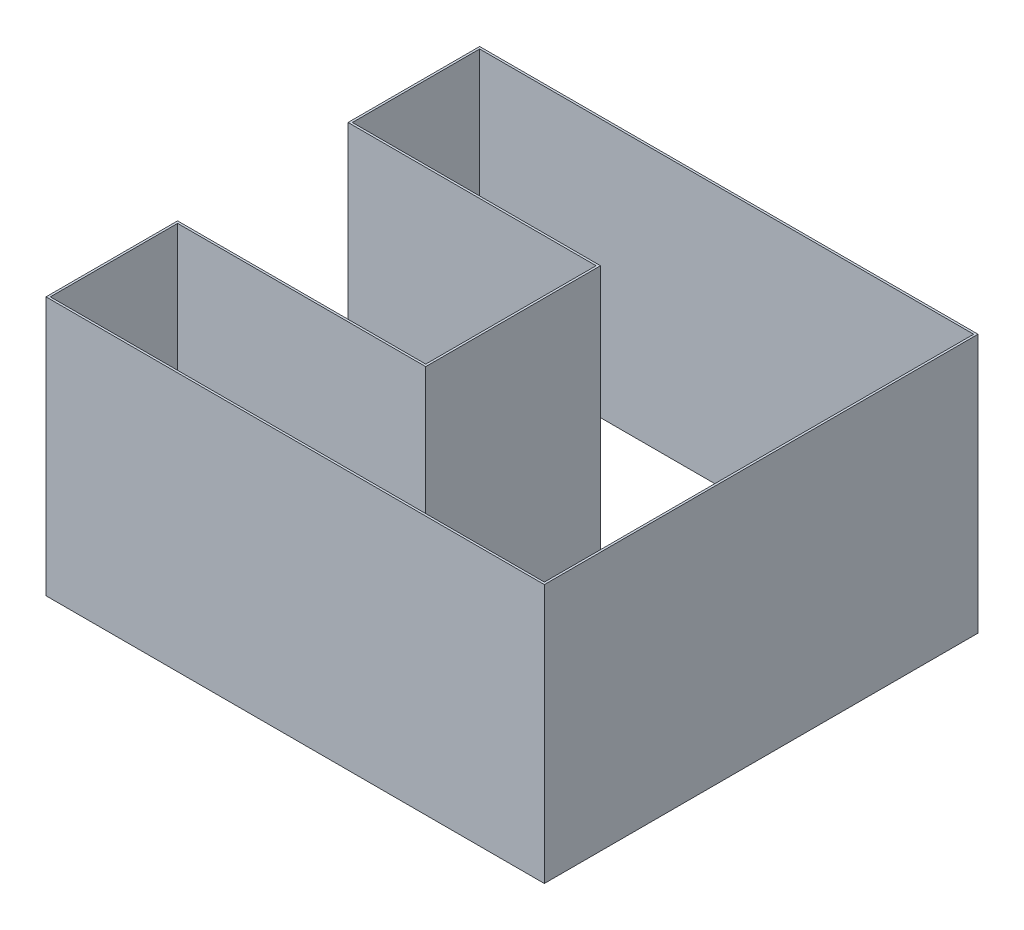
ISO-10303-21;
HEADER;
FILE_DESCRIPTION(('STEP AP214'),'2;1');
FILE_NAME('part.step','',(''),(''),'','','');
FILE_SCHEMA(('AUTOMOTIVE_DESIGN { 1 0 10303 214 1 1 1 1 }'));
ENDSEC;
DATA;
#1=APPLICATION_CONTEXT('core data for automotive mechanical design processes');
#2=APPLICATION_PROTOCOL_DEFINITION('international standard','automotive_design',2000,#1);
#3=PRODUCT_CONTEXT('',#1,'mechanical');
#4=PRODUCT('Part','Part','',(#3));
#5=PRODUCT_RELATED_PRODUCT_CATEGORY('part','',(#4));
#6=PRODUCT_DEFINITION_FORMATION('','',#4);
#7=PRODUCT_DEFINITION_CONTEXT('part definition',#1,'design');
#8=PRODUCT_DEFINITION('design','',#6,#7);
#9=PRODUCT_DEFINITION_SHAPE('','',#8);
#10=(LENGTH_UNIT() NAMED_UNIT(*) SI_UNIT(.MILLI.,.METRE.));
#11=(NAMED_UNIT(*) PLANE_ANGLE_UNIT() SI_UNIT($,.RADIAN.));
#12=(NAMED_UNIT(*) SI_UNIT($,.STERADIAN.) SOLID_ANGLE_UNIT());
#13=UNCERTAINTY_MEASURE_WITH_UNIT(LENGTH_MEASURE(1.E-05),#10,'distance_accuracy_value','');
#14=(GEOMETRIC_REPRESENTATION_CONTEXT(3) GLOBAL_UNCERTAINTY_ASSIGNED_CONTEXT((#13)) GLOBAL_UNIT_ASSIGNED_CONTEXT((#10,
#11,#12)) REPRESENTATION_CONTEXT('',''));
#15=CARTESIAN_POINT('',(0.,0.,0.));
#16=DIRECTION('',(0.,0.,1.));
#17=DIRECTION('',(1.,0.,0.));
#18=AXIS2_PLACEMENT_3D('',#15,#16,#17);
#19=CARTESIAN_POINT('',(0.,-0.12,0.));
#20=DIRECTION('',(0.,1.,0.));
#21=DIRECTION('',(0.,0.,1.));
#22=AXIS2_PLACEMENT_3D('',#19,#20,#21);
#23=PLANE('',#22);
#24=DIRECTION('',(-1.,0.,0.));
#25=VECTOR('',#24,1.);
#26=CARTESIAN_POINT('',(0.,-0.12,-0.04));
#27=LINE('',#26,#25);
#28=CARTESIAN_POINT('',(0.,-0.12,-0.04));
#29=VERTEX_POINT('',#28);
#30=CARTESIAN_POINT('',(-0.115,-0.12,-0.04));
#31=VERTEX_POINT('',#30);
#32=EDGE_CURVE('E260',#29,#31,#27,.T.);
#33=ORIENTED_EDGE('',*,*,#32,.T.);
#34=DIRECTION('',(0.,0.,1.));
#35=VECTOR('',#34,1.);
#36=CARTESIAN_POINT('',(-0.115,-0.12,0.));
#37=LINE('',#36,#35);
#38=CARTESIAN_POINT('',(-0.115,-0.12,-0.101));
#39=VERTEX_POINT('',#38);
#40=EDGE_CURVE('E262',#39,#31,#37,.T.);
#41=ORIENTED_EDGE('',*,*,#40,.F.);
#42=DIRECTION('',(1.,0.,0.));
#43=VECTOR('',#42,1.);
#44=CARTESIAN_POINT('',(0.,-0.12,-0.101));
#45=LINE('',#44,#43);
#46=CARTESIAN_POINT('',(0.116,-0.12,-0.101));
#47=VERTEX_POINT('',#46);
#48=EDGE_CURVE('E266',#39,#47,#45,.T.);
#49=ORIENTED_EDGE('',*,*,#48,.T.);
#50=DIRECTION('',(0.,0.,1.));
#51=VECTOR('',#50,1.);
#52=CARTESIAN_POINT('',(0.116,-0.12,0.));
#53=LINE('',#52,#51);
#54=CARTESIAN_POINT('',(0.116,-0.12,0.1));
#55=VERTEX_POINT('',#54);
#56=EDGE_CURVE('E268',#47,#55,#53,.T.);
#57=ORIENTED_EDGE('',*,*,#56,.T.);
#58=DIRECTION('',(1.,0.,0.));
#59=VECTOR('',#58,1.);
#60=CARTESIAN_POINT('',(0.,-0.12,0.1));
#61=LINE('',#60,#59);
#62=CARTESIAN_POINT('',(-0.115,-0.12,0.1));
#63=VERTEX_POINT('',#62);
#64=EDGE_CURVE('E270',#63,#55,#61,.T.);
#65=ORIENTED_EDGE('',*,*,#64,.F.);
#66=DIRECTION('',(0.,0.,1.));
#67=VECTOR('',#66,1.);
#68=CARTESIAN_POINT('',(-0.115,-0.12,0.));
#69=LINE('',#68,#67);
#70=CARTESIAN_POINT('',(-0.115,-0.12,0.039));
#71=VERTEX_POINT('',#70);
#72=EDGE_CURVE('E273',#71,#63,#69,.T.);
#73=ORIENTED_EDGE('',*,*,#72,.F.);
#74=DIRECTION('',(1.,0.,0.));
#75=VECTOR('',#74,1.);
#76=CARTESIAN_POINT('',(0.,-0.12,0.039));
#77=LINE('',#76,#75);
#78=CARTESIAN_POINT('',(0.,-0.12,0.039));
#79=VERTEX_POINT('',#78);
#80=EDGE_CURVE('E276',#71,#79,#77,.T.);
#81=ORIENTED_EDGE('',*,*,#80,.T.);
#82=DIRECTION('',(0.,0.,-1.));
#83=VECTOR('',#82,1.);
#84=CARTESIAN_POINT('',(0.,-0.12,0.));
#85=LINE('',#84,#83);
#86=EDGE_CURVE('E278',#79,#29,#85,.T.);
#87=ORIENTED_EDGE('',*,*,#86,.T.);
#88=EDGE_LOOP('',(#33,#41,#49,#57,#65,#73,#81,#87));
#89=FACE_BOUND('',#88,.T.);
#90=DIRECTION('',(-1.,0.,0.));
#91=VECTOR('',#90,1.);
#92=CARTESIAN_POINT('',(0.,-0.12,-0.041));
#93=LINE('',#92,#91);
#94=CARTESIAN_POINT('',(0.000999999999999997,-0.12,-0.041));
#95=VERTEX_POINT('',#94);
#96=CARTESIAN_POINT('',(-0.114,-0.12,-0.041));
#97=VERTEX_POINT('',#96);
#98=EDGE_CURVE('E192',#95,#97,#93,.T.);
#99=ORIENTED_EDGE('',*,*,#98,.F.);
#100=DIRECTION('',(0.,0.,-1.));
#101=VECTOR('',#100,1.);
#102=CARTESIAN_POINT('',(0.000999999999999997,-0.12,0.));
#103=LINE('',#102,#101);
#104=CARTESIAN_POINT('',(0.000999999999999997,-0.12,0.04));
#105=VERTEX_POINT('',#104);
#106=EDGE_CURVE('E228',#105,#95,#103,.T.);
#107=ORIENTED_EDGE('',*,*,#106,.F.);
#108=DIRECTION('',(1.,0.,0.));
#109=VECTOR('',#108,1.);
#110=CARTESIAN_POINT('',(0.,-0.12,0.04));
#111=LINE('',#110,#109);
#112=CARTESIAN_POINT('',(-0.114,-0.12,0.04));
#113=VERTEX_POINT('',#112);
#114=EDGE_CURVE('E226',#113,#105,#111,.T.);
#115=ORIENTED_EDGE('',*,*,#114,.F.);
#116=DIRECTION('',(0.,0.,1.));
#117=VECTOR('',#116,1.);
#118=CARTESIAN_POINT('',(-0.114,-0.12,0.));
#119=LINE('',#118,#117);
#120=CARTESIAN_POINT('',(-0.114,-0.12,0.099));
#121=VERTEX_POINT('',#120);
#122=EDGE_CURVE('E223',#113,#121,#119,.T.);
#123=ORIENTED_EDGE('',*,*,#122,.T.);
#124=DIRECTION('',(1.,0.,0.));
#125=VECTOR('',#124,1.);
#126=CARTESIAN_POINT('',(0.,-0.12,0.099));
#127=LINE('',#126,#125);
#128=CARTESIAN_POINT('',(0.115,-0.12,0.099));
#129=VERTEX_POINT('',#128);
#130=EDGE_CURVE('E220',#121,#129,#127,.T.);
#131=ORIENTED_EDGE('',*,*,#130,.T.);
#132=DIRECTION('',(0.,0.,1.));
#133=VECTOR('',#132,1.);
#134=CARTESIAN_POINT('',(0.115,-0.12,0.));
#135=LINE('',#134,#133);
#136=CARTESIAN_POINT('',(0.115,-0.12,-0.1));
#137=VERTEX_POINT('',#136);
#138=EDGE_CURVE('E216',#137,#129,#135,.T.);
#139=ORIENTED_EDGE('',*,*,#138,.F.);
#140=DIRECTION('',(1.,0.,0.));
#141=VECTOR('',#140,1.);
#142=CARTESIAN_POINT('',(0.,-0.12,-0.1));
#143=LINE('',#142,#141);
#144=CARTESIAN_POINT('',(-0.114,-0.12,-0.1));
#145=VERTEX_POINT('',#144);
#146=EDGE_CURVE('E214',#145,#137,#143,.T.);
#147=ORIENTED_EDGE('',*,*,#146,.F.);
#148=DIRECTION('',(0.,0.,1.));
#149=VECTOR('',#148,1.);
#150=CARTESIAN_POINT('',(-0.114,-0.12,0.));
#151=LINE('',#150,#149);
#152=EDGE_CURVE('E201',#145,#97,#151,.T.);
#153=ORIENTED_EDGE('',*,*,#152,.T.);
#154=EDGE_LOOP('',(#99,#107,#115,#123,#131,#139,#147,#153));
#155=FACE_BOUND('',#154,.T.);
#156=ADVANCED_FACE('F81',(#89,#155),#23,.F.);
#157=CARTESIAN_POINT('',(0.,0.,0.));
#158=DIRECTION('',(0.,1.,0.));
#159=DIRECTION('',(0.,0.,1.));
#160=AXIS2_PLACEMENT_3D('',#157,#158,#159);
#161=PLANE('',#160);
#162=DIRECTION('',(-1.,0.,0.));
#163=VECTOR('',#162,1.);
#164=CARTESIAN_POINT('',(0.,0.,-0.04));
#165=LINE('',#164,#163);
#166=CARTESIAN_POINT('',(0.,0.,-0.04));
#167=VERTEX_POINT('',#166);
#168=CARTESIAN_POINT('',(-0.115,0.,-0.04));
#169=VERTEX_POINT('',#168);
#170=EDGE_CURVE('E210',#167,#169,#165,.T.);
#171=ORIENTED_EDGE('',*,*,#170,.F.);
#172=DIRECTION('',(0.,0.,-1.));
#173=VECTOR('',#172,1.);
#174=CARTESIAN_POINT('',(0.,0.,0.));
#175=LINE('',#174,#173);
#176=CARTESIAN_POINT('',(0.,0.,0.039));
#177=VERTEX_POINT('',#176);
#178=EDGE_CURVE('E263',#177,#167,#175,.T.);
#179=ORIENTED_EDGE('',*,*,#178,.F.);
#180=DIRECTION('',(1.,0.,0.));
#181=VECTOR('',#180,1.);
#182=CARTESIAN_POINT('',(0.,0.,0.039));
#183=LINE('',#182,#181);
#184=CARTESIAN_POINT('',(-0.115,0.,0.039));
#185=VERTEX_POINT('',#184);
#186=EDGE_CURVE('E297',#185,#177,#183,.T.);
#187=ORIENTED_EDGE('',*,*,#186,.F.);
#188=DIRECTION('',(0.,0.,1.));
#189=VECTOR('',#188,1.);
#190=CARTESIAN_POINT('',(-0.115,0.,0.));
#191=LINE('',#190,#189);
#192=CARTESIAN_POINT('',(-0.115,0.,0.1));
#193=VERTEX_POINT('',#192);
#194=EDGE_CURVE('E294',#185,#193,#191,.T.);
#195=ORIENTED_EDGE('',*,*,#194,.T.);
#196=DIRECTION('',(1.,0.,0.));
#197=VECTOR('',#196,1.);
#198=CARTESIAN_POINT('',(0.,0.,0.1));
#199=LINE('',#198,#197);
#200=CARTESIAN_POINT('',(0.116,0.,0.1));
#201=VERTEX_POINT('',#200);
#202=EDGE_CURVE('E291',#193,#201,#199,.T.);
#203=ORIENTED_EDGE('',*,*,#202,.T.);
#204=DIRECTION('',(0.,0.,1.));
#205=VECTOR('',#204,1.);
#206=CARTESIAN_POINT('',(0.116,0.,0.));
#207=LINE('',#206,#205);
#208=CARTESIAN_POINT('',(0.116,0.,-0.101));
#209=VERTEX_POINT('',#208);
#210=EDGE_CURVE('E288',#209,#201,#207,.T.);
#211=ORIENTED_EDGE('',*,*,#210,.F.);
#212=DIRECTION('',(1.,0.,0.));
#213=VECTOR('',#212,1.);
#214=CARTESIAN_POINT('',(0.,0.,-0.101));
#215=LINE('',#214,#213);
#216=CARTESIAN_POINT('',(-0.115,0.,-0.101));
#217=VERTEX_POINT('',#216);
#218=EDGE_CURVE('E286',#217,#209,#215,.T.);
#219=ORIENTED_EDGE('',*,*,#218,.F.);
#220=DIRECTION('',(0.,0.,1.));
#221=VECTOR('',#220,1.);
#222=CARTESIAN_POINT('',(-0.115,0.,0.));
#223=LINE('',#222,#221);
#224=EDGE_CURVE('E283',#217,#169,#223,.T.);
#225=ORIENTED_EDGE('',*,*,#224,.T.);
#226=EDGE_LOOP('',(#171,#179,#187,#195,#203,#211,#219,#225));
#227=FACE_BOUND('',#226,.T.);
#228=DIRECTION('',(0.,0.,-1.));
#229=VECTOR('',#228,1.);
#230=CARTESIAN_POINT('',(0.000999999999999997,0.,0.));
#231=LINE('',#230,#229);
#232=CARTESIAN_POINT('',(0.000999999999999997,0.,0.04));
#233=VERTEX_POINT('',#232);
#234=CARTESIAN_POINT('',(0.000999999999999997,0.,-0.041));
#235=VERTEX_POINT('',#234);
#236=EDGE_CURVE('E202',#233,#235,#231,.T.);
#237=ORIENTED_EDGE('',*,*,#236,.T.);
#238=DIRECTION('',(-1.,0.,0.));
#239=VECTOR('',#238,1.);
#240=CARTESIAN_POINT('',(0.,0.,-0.041));
#241=LINE('',#240,#239);
#242=CARTESIAN_POINT('',(-0.114,0.,-0.041));
#243=VERTEX_POINT('',#242);
#244=EDGE_CURVE('E104',#235,#243,#241,.T.);
#245=ORIENTED_EDGE('',*,*,#244,.T.);
#246=DIRECTION('',(0.,0.,1.));
#247=VECTOR('',#246,1.);
#248=CARTESIAN_POINT('',(-0.114,0.,0.));
#249=LINE('',#248,#247);
#250=CARTESIAN_POINT('',(-0.114,0.,-0.1));
#251=VERTEX_POINT('',#250);
#252=EDGE_CURVE('E209',#251,#243,#249,.T.);
#253=ORIENTED_EDGE('',*,*,#252,.F.);
#254=DIRECTION('',(1.,0.,0.));
#255=VECTOR('',#254,1.);
#256=CARTESIAN_POINT('',(0.,0.,-0.1));
#257=LINE('',#256,#255);
#258=CARTESIAN_POINT('',(0.115,0.,-0.1));
#259=VERTEX_POINT('',#258);
#260=EDGE_CURVE('E232',#251,#259,#257,.T.);
#261=ORIENTED_EDGE('',*,*,#260,.T.);
#262=DIRECTION('',(0.,0.,1.));
#263=VECTOR('',#262,1.);
#264=CARTESIAN_POINT('',(0.115,0.,0.));
#265=LINE('',#264,#263);
#266=CARTESIAN_POINT('',(0.115,0.,0.099));
#267=VERTEX_POINT('',#266);
#268=EDGE_CURVE('E235',#259,#267,#265,.T.);
#269=ORIENTED_EDGE('',*,*,#268,.T.);
#270=DIRECTION('',(1.,0.,0.));
#271=VECTOR('',#270,1.);
#272=CARTESIAN_POINT('',(0.,0.,0.099));
#273=LINE('',#272,#271);
#274=CARTESIAN_POINT('',(-0.114,0.,0.099));
#275=VERTEX_POINT('',#274);
#276=EDGE_CURVE('E238',#275,#267,#273,.T.);
#277=ORIENTED_EDGE('',*,*,#276,.F.);
#278=DIRECTION('',(0.,0.,1.));
#279=VECTOR('',#278,1.);
#280=CARTESIAN_POINT('',(-0.114,0.,0.));
#281=LINE('',#280,#279);
#282=CARTESIAN_POINT('',(-0.114,0.,0.04));
#283=VERTEX_POINT('',#282);
#284=EDGE_CURVE('E241',#283,#275,#281,.T.);
#285=ORIENTED_EDGE('',*,*,#284,.F.);
#286=DIRECTION('',(1.,0.,0.));
#287=VECTOR('',#286,1.);
#288=CARTESIAN_POINT('',(0.,0.,0.04));
#289=LINE('',#288,#287);
#290=EDGE_CURVE('E244',#283,#233,#289,.T.);
#291=ORIENTED_EDGE('',*,*,#290,.T.);
#292=EDGE_LOOP('',(#237,#245,#253,#261,#269,#277,#285,#291));
#293=FACE_BOUND('',#292,.T.);
#294=ADVANCED_FACE('F324',(#227,#293),#161,.T.);
#295=CARTESIAN_POINT('',(0.,-0.12,-0.04));
#296=DIRECTION('',(0.,0.,-1.));
#297=DIRECTION('',(-1.,0.,0.));
#298=AXIS2_PLACEMENT_3D('',#295,#296,#297);
#299=PLANE('',#298);
#300=ORIENTED_EDGE('',*,*,#170,.T.);
#301=DIRECTION('',(0.,1.,0.));
#302=VECTOR('',#301,1.);
#303=CARTESIAN_POINT('',(-0.115,-0.12,-0.04));
#304=LINE('',#303,#302);
#305=EDGE_CURVE('E12',#31,#169,#304,.T.);
#306=ORIENTED_EDGE('',*,*,#305,.F.);
#307=ORIENTED_EDGE('',*,*,#32,.F.);
#308=DIRECTION('',(0.,1.,0.));
#309=VECTOR('',#308,1.);
#310=CARTESIAN_POINT('',(0.,-0.12,-0.04));
#311=LINE('',#310,#309);
#312=EDGE_CURVE('E280',#29,#167,#311,.T.);
#313=ORIENTED_EDGE('',*,*,#312,.T.);
#314=EDGE_LOOP('',(#300,#306,#307,#313));
#315=FACE_BOUND('',#314,.T.);
#316=ADVANCED_FACE('F83',(#315),#299,.F.);
#317=CARTESIAN_POINT('',(-0.115,-0.12,0.));
#318=DIRECTION('',(-1.,0.,0.));
#319=DIRECTION('',(0.,0.,1.));
#320=AXIS2_PLACEMENT_3D('',#317,#318,#319);
#321=PLANE('',#320);
#322=ORIENTED_EDGE('',*,*,#224,.F.);
#323=DIRECTION('',(0.,1.,0.));
#324=VECTOR('',#323,1.);
#325=CARTESIAN_POINT('',(-0.115,-0.12,-0.101));
#326=LINE('',#325,#324);
#327=EDGE_CURVE('E89',#39,#217,#326,.T.);
#328=ORIENTED_EDGE('',*,*,#327,.F.);
#329=ORIENTED_EDGE('',*,*,#40,.T.);
#330=ORIENTED_EDGE('',*,*,#305,.T.);
#331=EDGE_LOOP('',(#322,#328,#329,#330));
#332=FACE_BOUND('',#331,.T.);
#333=ADVANCED_FACE('F326',(#332),#321,.T.);
#334=CARTESIAN_POINT('',(0.,-0.12,-0.101));
#335=DIRECTION('',(0.,0.,1.));
#336=DIRECTION('',(1.,0.,0.));
#337=AXIS2_PLACEMENT_3D('',#334,#335,#336);
#338=PLANE('',#337);
#339=ORIENTED_EDGE('',*,*,#218,.T.);
#340=DIRECTION('',(0.,1.,0.));
#341=VECTOR('',#340,1.);
#342=CARTESIAN_POINT('',(0.116,-0.12,-0.101));
#343=LINE('',#342,#341);
#344=EDGE_CURVE('E311',#47,#209,#343,.T.);
#345=ORIENTED_EDGE('',*,*,#344,.F.);
#346=ORIENTED_EDGE('',*,*,#48,.F.);
#347=ORIENTED_EDGE('',*,*,#327,.T.);
#348=EDGE_LOOP('',(#339,#345,#346,#347));
#349=FACE_BOUND('',#348,.T.);
#350=ADVANCED_FACE('F316',(#349),#338,.F.);
#351=CARTESIAN_POINT('',(0.116,-0.12,0.));
#352=DIRECTION('',(-1.,0.,0.));
#353=DIRECTION('',(0.,0.,1.));
#354=AXIS2_PLACEMENT_3D('',#351,#352,#353);
#355=PLANE('',#354);
#356=ORIENTED_EDGE('',*,*,#210,.T.);
#357=DIRECTION('',(0.,1.,0.));
#358=VECTOR('',#357,1.);
#359=CARTESIAN_POINT('',(0.116,-0.12,0.1));
#360=LINE('',#359,#358);
#361=EDGE_CURVE('E309',#55,#201,#360,.T.);
#362=ORIENTED_EDGE('',*,*,#361,.F.);
#363=ORIENTED_EDGE('',*,*,#56,.F.);
#364=ORIENTED_EDGE('',*,*,#344,.T.);
#365=EDGE_LOOP('',(#356,#362,#363,#364));
#366=FACE_BOUND('',#365,.T.);
#367=ADVANCED_FACE('F351',(#366),#355,.F.);
#368=CARTESIAN_POINT('',(0.,-0.12,0.1));
#369=DIRECTION('',(0.,0.,1.));
#370=DIRECTION('',(1.,0.,0.));
#371=AXIS2_PLACEMENT_3D('',#368,#369,#370);
#372=PLANE('',#371);
#373=ORIENTED_EDGE('',*,*,#202,.F.);
#374=DIRECTION('',(0.,1.,0.));
#375=VECTOR('',#374,1.);
#376=CARTESIAN_POINT('',(-0.115,-0.12,0.1));
#377=LINE('',#376,#375);
#378=EDGE_CURVE('E307',#63,#193,#377,.T.);
#379=ORIENTED_EDGE('',*,*,#378,.F.);
#380=ORIENTED_EDGE('',*,*,#64,.T.);
#381=ORIENTED_EDGE('',*,*,#361,.T.);
#382=EDGE_LOOP('',(#373,#379,#380,#381));
#383=FACE_BOUND('',#382,.T.);
#384=ADVANCED_FACE('F346',(#383),#372,.T.);
#385=CARTESIAN_POINT('',(-0.115,-0.12,0.));
#386=DIRECTION('',(-1.,0.,0.));
#387=DIRECTION('',(0.,0.,1.));
#388=AXIS2_PLACEMENT_3D('',#385,#386,#387);
#389=PLANE('',#388);
#390=ORIENTED_EDGE('',*,*,#194,.F.);
#391=DIRECTION('',(0.,1.,0.));
#392=VECTOR('',#391,1.);
#393=CARTESIAN_POINT('',(-0.115,-0.12,0.039));
#394=LINE('',#393,#392);
#395=EDGE_CURVE('E305',#71,#185,#394,.T.);
#396=ORIENTED_EDGE('',*,*,#395,.F.);
#397=ORIENTED_EDGE('',*,*,#72,.T.);
#398=ORIENTED_EDGE('',*,*,#378,.T.);
#399=EDGE_LOOP('',(#390,#396,#397,#398));
#400=FACE_BOUND('',#399,.T.);
#401=ADVANCED_FACE('F343',(#400),#389,.T.);
#402=CARTESIAN_POINT('',(0.,-0.12,0.039));
#403=DIRECTION('',(0.,0.,1.));
#404=DIRECTION('',(1.,0.,0.));
#405=AXIS2_PLACEMENT_3D('',#402,#403,#404);
#406=PLANE('',#405);
#407=ORIENTED_EDGE('',*,*,#186,.T.);
#408=DIRECTION('',(0.,1.,0.));
#409=VECTOR('',#408,1.);
#410=CARTESIAN_POINT('',(0.,-0.12,0.039));
#411=LINE('',#410,#409);
#412=EDGE_CURVE('E302',#79,#177,#411,.T.);
#413=ORIENTED_EDGE('',*,*,#412,.F.);
#414=ORIENTED_EDGE('',*,*,#80,.F.);
#415=ORIENTED_EDGE('',*,*,#395,.T.);
#416=EDGE_LOOP('',(#407,#413,#414,#415));
#417=FACE_BOUND('',#416,.T.);
#418=ADVANCED_FACE('F340',(#417),#406,.F.);
#419=CARTESIAN_POINT('',(0.,-0.12,0.));
#420=DIRECTION('',(1.,0.,0.));
#421=DIRECTION('',(0.,0.,-1.));
#422=AXIS2_PLACEMENT_3D('',#419,#420,#421);
#423=PLANE('',#422);
#424=ORIENTED_EDGE('',*,*,#178,.T.);
#425=ORIENTED_EDGE('',*,*,#312,.F.);
#426=ORIENTED_EDGE('',*,*,#86,.F.);
#427=ORIENTED_EDGE('',*,*,#412,.T.);
#428=EDGE_LOOP('',(#424,#425,#426,#427));
#429=FACE_BOUND('',#428,.T.);
#430=ADVANCED_FACE('F335',(#429),#423,.F.);
#431=CARTESIAN_POINT('',(0.,-0.12,-0.041));
#432=DIRECTION('',(0.,0.,-1.));
#433=DIRECTION('',(-1.,0.,0.));
#434=AXIS2_PLACEMENT_3D('',#431,#432,#433);
#435=PLANE('',#434);
#436=ORIENTED_EDGE('',*,*,#244,.F.);
#437=DIRECTION('',(0.,1.,0.));
#438=VECTOR('',#437,1.);
#439=CARTESIAN_POINT('',(0.000999999999999997,-0.12,-0.041));
#440=LINE('',#439,#438);
#441=EDGE_CURVE('E197',#95,#235,#440,.T.);
#442=ORIENTED_EDGE('',*,*,#441,.F.);
#443=ORIENTED_EDGE('',*,*,#98,.T.);
#444=DIRECTION('',(0.,1.,0.));
#445=VECTOR('',#444,1.);
#446=CARTESIAN_POINT('',(-0.114,-0.12,-0.041));
#447=LINE('',#446,#445);
#448=EDGE_CURVE('E195',#97,#243,#447,.T.);
#449=ORIENTED_EDGE('',*,*,#448,.T.);
#450=EDGE_LOOP('',(#436,#442,#443,#449));
#451=FACE_BOUND('',#450,.T.);
#452=ADVANCED_FACE('F194',(#451),#435,.T.);
#453=CARTESIAN_POINT('',(-0.114,-0.12,0.));
#454=DIRECTION('',(-1.,0.,0.));
#455=DIRECTION('',(0.,0.,1.));
#456=AXIS2_PLACEMENT_3D('',#453,#454,#455);
#457=PLANE('',#456);
#458=ORIENTED_EDGE('',*,*,#252,.T.);
#459=ORIENTED_EDGE('',*,*,#448,.F.);
#460=ORIENTED_EDGE('',*,*,#152,.F.);
#461=DIRECTION('',(0.,1.,0.));
#462=VECTOR('',#461,1.);
#463=CARTESIAN_POINT('',(-0.114,-0.12,-0.1));
#464=LINE('',#463,#462);
#465=EDGE_CURVE('E211',#145,#251,#464,.T.);
#466=ORIENTED_EDGE('',*,*,#465,.T.);
#467=EDGE_LOOP('',(#458,#459,#460,#466));
#468=FACE_BOUND('',#467,.T.);
#469=ADVANCED_FACE('F206',(#468),#457,.F.);
#470=CARTESIAN_POINT('',(0.,-0.12,-0.1));
#471=DIRECTION('',(0.,0.,1.));
#472=DIRECTION('',(1.,0.,0.));
#473=AXIS2_PLACEMENT_3D('',#470,#471,#472);
#474=PLANE('',#473);
#475=ORIENTED_EDGE('',*,*,#260,.F.);
#476=ORIENTED_EDGE('',*,*,#465,.F.);
#477=ORIENTED_EDGE('',*,*,#146,.T.);
#478=DIRECTION('',(0.,1.,0.));
#479=VECTOR('',#478,1.);
#480=CARTESIAN_POINT('',(0.115,-0.12,-0.1));
#481=LINE('',#480,#479);
#482=EDGE_CURVE('E257',#137,#259,#481,.T.);
#483=ORIENTED_EDGE('',*,*,#482,.T.);
#484=EDGE_LOOP('',(#475,#476,#477,#483));
#485=FACE_BOUND('',#484,.T.);
#486=ADVANCED_FACE('F451',(#485),#474,.T.);
#487=CARTESIAN_POINT('',(0.115,-0.12,0.));
#488=DIRECTION('',(-1.,0.,0.));
#489=DIRECTION('',(0.,0.,1.));
#490=AXIS2_PLACEMENT_3D('',#487,#488,#489);
#491=PLANE('',#490);
#492=ORIENTED_EDGE('',*,*,#268,.F.);
#493=ORIENTED_EDGE('',*,*,#482,.F.);
#494=ORIENTED_EDGE('',*,*,#138,.T.);
#495=DIRECTION('',(0.,1.,0.));
#496=VECTOR('',#495,1.);
#497=CARTESIAN_POINT('',(0.115,-0.12,0.099));
#498=LINE('',#497,#496);
#499=EDGE_CURVE('E255',#129,#267,#498,.T.);
#500=ORIENTED_EDGE('',*,*,#499,.T.);
#501=EDGE_LOOP('',(#492,#493,#494,#500));
#502=FACE_BOUND('',#501,.T.);
#503=ADVANCED_FACE('F458',(#502),#491,.T.);
#504=CARTESIAN_POINT('',(0.,-0.12,0.099));
#505=DIRECTION('',(0.,0.,1.));
#506=DIRECTION('',(1.,0.,0.));
#507=AXIS2_PLACEMENT_3D('',#504,#505,#506);
#508=PLANE('',#507);
#509=ORIENTED_EDGE('',*,*,#276,.T.);
#510=ORIENTED_EDGE('',*,*,#499,.F.);
#511=ORIENTED_EDGE('',*,*,#130,.F.);
#512=DIRECTION('',(0.,1.,0.));
#513=VECTOR('',#512,1.);
#514=CARTESIAN_POINT('',(-0.114,-0.12,0.099));
#515=LINE('',#514,#513);
#516=EDGE_CURVE('E253',#121,#275,#515,.T.);
#517=ORIENTED_EDGE('',*,*,#516,.T.);
#518=EDGE_LOOP('',(#509,#510,#511,#517));
#519=FACE_BOUND('',#518,.T.);
#520=ADVANCED_FACE('F467',(#519),#508,.F.);
#521=CARTESIAN_POINT('',(-0.114,-0.12,0.));
#522=DIRECTION('',(-1.,0.,0.));
#523=DIRECTION('',(0.,0.,1.));
#524=AXIS2_PLACEMENT_3D('',#521,#522,#523);
#525=PLANE('',#524);
#526=ORIENTED_EDGE('',*,*,#284,.T.);
#527=ORIENTED_EDGE('',*,*,#516,.F.);
#528=ORIENTED_EDGE('',*,*,#122,.F.);
#529=DIRECTION('',(0.,1.,0.));
#530=VECTOR('',#529,1.);
#531=CARTESIAN_POINT('',(-0.114,-0.12,0.04));
#532=LINE('',#531,#530);
#533=EDGE_CURVE('E251',#113,#283,#532,.T.);
#534=ORIENTED_EDGE('',*,*,#533,.T.);
#535=EDGE_LOOP('',(#526,#527,#528,#534));
#536=FACE_BOUND('',#535,.T.);
#537=ADVANCED_FACE('F476',(#536),#525,.F.);
#538=CARTESIAN_POINT('',(0.,-0.12,0.04));
#539=DIRECTION('',(0.,0.,1.));
#540=DIRECTION('',(1.,0.,0.));
#541=AXIS2_PLACEMENT_3D('',#538,#539,#540);
#542=PLANE('',#541);
#543=ORIENTED_EDGE('',*,*,#290,.F.);
#544=ORIENTED_EDGE('',*,*,#533,.F.);
#545=ORIENTED_EDGE('',*,*,#114,.T.);
#546=DIRECTION('',(0.,1.,0.));
#547=VECTOR('',#546,1.);
#548=CARTESIAN_POINT('',(0.000999999999999997,-0.12,0.04));
#549=LINE('',#548,#547);
#550=EDGE_CURVE('E96',#105,#233,#549,.T.);
#551=ORIENTED_EDGE('',*,*,#550,.T.);
#552=EDGE_LOOP('',(#543,#544,#545,#551));
#553=FACE_BOUND('',#552,.T.);
#554=ADVANCED_FACE('F485',(#553),#542,.T.);
#555=CARTESIAN_POINT('',(0.000999999999999997,-0.12,0.));
#556=DIRECTION('',(1.,0.,0.));
#557=DIRECTION('',(0.,0.,-1.));
#558=AXIS2_PLACEMENT_3D('',#555,#556,#557);
#559=PLANE('',#558);
#560=ORIENTED_EDGE('',*,*,#236,.F.);
#561=ORIENTED_EDGE('',*,*,#550,.F.);
#562=ORIENTED_EDGE('',*,*,#106,.T.);
#563=ORIENTED_EDGE('',*,*,#441,.T.);
#564=EDGE_LOOP('',(#560,#561,#562,#563));
#565=FACE_BOUND('',#564,.T.);
#566=ADVANCED_FACE('F494',(#565),#559,.T.);
#567=CLOSED_SHELL('',(#156,#294,#316,#333,#350,#367,#384,#401,#418,#430,#452,#469,#486,#503,
#520,#537,#554,#566));
#568=MANIFOLD_SOLID_BREP('B2',#567);
#569=ADVANCED_BREP_SHAPE_REPRESENTATION('',(#18,#568),#14);
#570=SHAPE_DEFINITION_REPRESENTATION(#9,#569);
ENDSEC;
END-ISO-10303-21;
